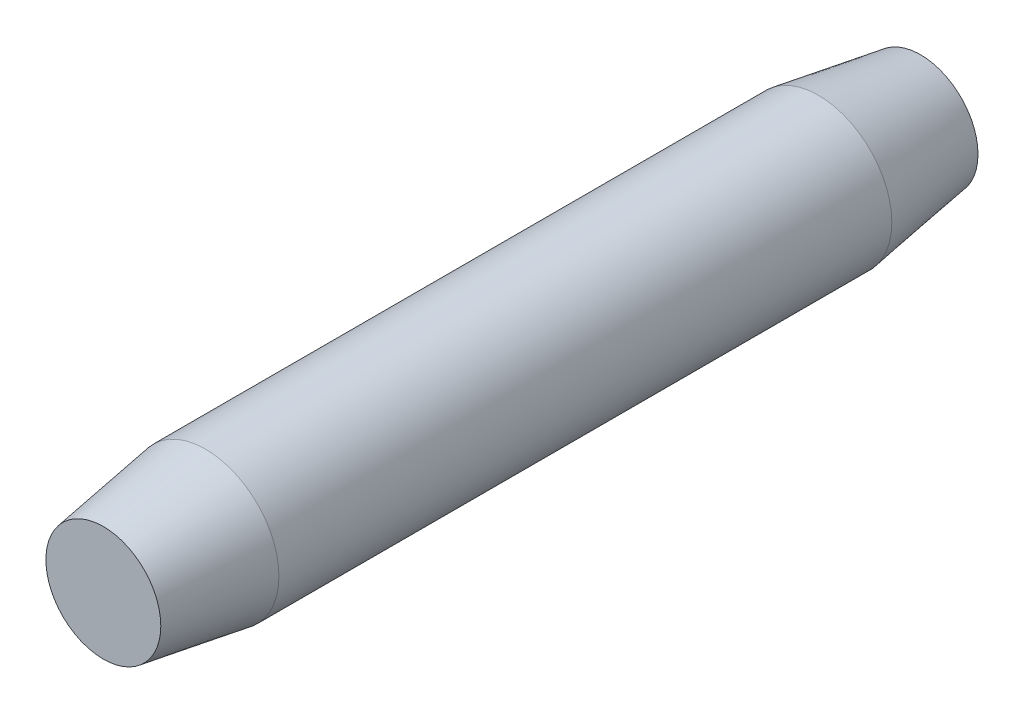
ISO-10303-21;
HEADER;
FILE_DESCRIPTION(('STEP AP214'),'2;1');
FILE_NAME('part.step','',(''),(''),'','','');
FILE_SCHEMA(('AUTOMOTIVE_DESIGN { 1 0 10303 214 1 1 1 1 }'));
ENDSEC;
DATA;
#1=APPLICATION_CONTEXT('core data for automotive mechanical design processes');
#2=APPLICATION_PROTOCOL_DEFINITION('international standard','automotive_design',2000,#1);
#3=PRODUCT_CONTEXT('',#1,'mechanical');
#4=PRODUCT('Part','Part','',(#3));
#5=PRODUCT_RELATED_PRODUCT_CATEGORY('part','',(#4));
#6=PRODUCT_DEFINITION_FORMATION('','',#4);
#7=PRODUCT_DEFINITION_CONTEXT('part definition',#1,'design');
#8=PRODUCT_DEFINITION('design','',#6,#7);
#9=PRODUCT_DEFINITION_SHAPE('','',#8);
#10=(LENGTH_UNIT() NAMED_UNIT(*) SI_UNIT(.MILLI.,.METRE.));
#11=(NAMED_UNIT(*) PLANE_ANGLE_UNIT() SI_UNIT($,.RADIAN.));
#12=(NAMED_UNIT(*) SI_UNIT($,.STERADIAN.) SOLID_ANGLE_UNIT());
#13=UNCERTAINTY_MEASURE_WITH_UNIT(LENGTH_MEASURE(1.E-05),#10,'distance_accuracy_value','');
#14=(GEOMETRIC_REPRESENTATION_CONTEXT(3) GLOBAL_UNCERTAINTY_ASSIGNED_CONTEXT((#13)) GLOBAL_UNIT_ASSIGNED_CONTEXT((#10,
#11,#12)) REPRESENTATION_CONTEXT('',''));
#15=CARTESIAN_POINT('',(0.,0.,0.));
#16=DIRECTION('',(0.,0.,1.));
#17=DIRECTION('',(1.,0.,0.));
#18=AXIS2_PLACEMENT_3D('',#15,#16,#17);
#19=CARTESIAN_POINT('',(0.,0.,101.6));
#20=DIRECTION('',(0.,0.,-1.));
#21=DIRECTION('',(-1.,0.,0.));
#22=AXIS2_PLACEMENT_3D('',#19,#20,#21);
#23=CYLINDRICAL_SURFACE('',#22,18.25625);
#24=CARTESIAN_POINT('',(0.,0.,-76.1999999999989));
#25=DIRECTION('',(0.,0.,1.));
#26=DIRECTION('',(1.,0.,0.));
#27=AXIS2_PLACEMENT_3D('',#24,#25,#26);
#28=CIRCLE('',#27,18.25625);
#29=CARTESIAN_POINT('',(18.25625,0.,-76.1999999999989));
#30=VERTEX_POINT('',#29);
#31=EDGE_CURVE('E39',#30,#30,#28,.T.);
#32=ORIENTED_EDGE('',*,*,#31,.T.);
#33=EDGE_LOOP('',(#32));
#34=FACE_BOUND('',#33,.T.);
#35=CARTESIAN_POINT('',(0.,0.,76.1999999999998));
#36=DIRECTION('',(0.,0.,1.));
#37=DIRECTION('',(1.,0.,0.));
#38=AXIS2_PLACEMENT_3D('',#35,#36,#37);
#39=CIRCLE('',#38,18.25625);
#40=CARTESIAN_POINT('',(18.25625,0.,76.1999999999998));
#41=VERTEX_POINT('',#40);
#42=EDGE_CURVE('E43',#41,#41,#39,.F.);
#43=ORIENTED_EDGE('',*,*,#42,.T.);
#44=EDGE_LOOP('',(#43));
#45=FACE_BOUND('',#44,.T.);
#46=ADVANCED_FACE('F32',(#34,#45),#23,.T.);
#47=CARTESIAN_POINT('',(0.,0.,101.6));
#48=DIRECTION('',(0.,0.,1.));
#49=DIRECTION('',(1.,0.,0.));
#50=AXIS2_PLACEMENT_3D('',#47,#48,#49);
#51=PLANE('',#50);
#52=CARTESIAN_POINT('',(0.,0.,101.6));
#53=DIRECTION('',(0.,0.,1.));
#54=DIRECTION('',(1.,0.,0.));
#55=AXIS2_PLACEMENT_3D('',#52,#53,#54);
#56=CIRCLE('',#55,14.2875000000001);
#57=CARTESIAN_POINT('',(14.2875000000001,0.,101.6));
#58=VERTEX_POINT('',#57);
#59=EDGE_CURVE('E47',#58,#58,#56,.T.);
#60=ORIENTED_EDGE('',*,*,#59,.T.);
#61=EDGE_LOOP('',(#60));
#62=FACE_BOUND('',#61,.T.);
#63=ADVANCED_FACE('F53',(#62),#51,.T.);
#64=CARTESIAN_POINT('',(0.,0.,-101.6));
#65=DIRECTION('',(0.,0.,1.));
#66=DIRECTION('',(1.,0.,0.));
#67=AXIS2_PLACEMENT_3D('',#64,#65,#66);
#68=PLANE('',#67);
#69=CARTESIAN_POINT('',(0.,0.,-101.6));
#70=DIRECTION('',(0.,0.,1.));
#71=DIRECTION('',(1.,0.,0.));
#72=AXIS2_PLACEMENT_3D('',#69,#70,#71);
#73=CIRCLE('',#72,14.2874999999999);
#74=CARTESIAN_POINT('',(14.2874999999999,0.,-101.6));
#75=VERTEX_POINT('',#74);
#76=EDGE_CURVE('E10',#75,#75,#73,.F.);
#77=ORIENTED_EDGE('',*,*,#76,.T.);
#78=EDGE_LOOP('',(#77));
#79=FACE_BOUND('',#78,.T.);
#80=ADVANCED_FACE('F57',(#79),#68,.F.);
#81=CARTESIAN_POINT('',(0.,0.,101.6));
#82=DIRECTION('',(0.,0.,-1.));
#83=DIRECTION('',(-1.,0.,0.));
#84=AXIS2_PLACEMENT_3D('',#81,#82,#83);
#85=CONICAL_SURFACE('',#84,14.2875000000001,0.154996741923938);
#86=ORIENTED_EDGE('',*,*,#42,.F.);
#87=EDGE_LOOP('',(#86));
#88=FACE_BOUND('',#87,.T.);
#89=ORIENTED_EDGE('',*,*,#59,.F.);
#90=EDGE_LOOP('',(#89));
#91=FACE_BOUND('',#90,.T.);
#92=ADVANCED_FACE('F55',(#88,#91),#85,.T.);
#93=CARTESIAN_POINT('',(0.,0.,-76.1999999999989));
#94=DIRECTION('',(0.,0.,1.));
#95=DIRECTION('',(1.,0.,0.));
#96=AXIS2_PLACEMENT_3D('',#93,#94,#95);
#97=CONICAL_SURFACE('',#96,18.25625,0.154996741923938);
#98=ORIENTED_EDGE('',*,*,#76,.F.);
#99=EDGE_LOOP('',(#98));
#100=FACE_BOUND('',#99,.T.);
#101=ORIENTED_EDGE('',*,*,#31,.F.);
#102=EDGE_LOOP('',(#101));
#103=FACE_BOUND('',#102,.T.);
#104=ADVANCED_FACE('F34',(#100,#103),#97,.T.);
#105=CLOSED_SHELL('',(#46,#63,#80,#92,#104));
#106=MANIFOLD_SOLID_BREP('B2',#105);
#107=ADVANCED_BREP_SHAPE_REPRESENTATION('',(#18,#106),#14);
#108=SHAPE_DEFINITION_REPRESENTATION(#9,#107);
ENDSEC;
END-ISO-10303-21;
